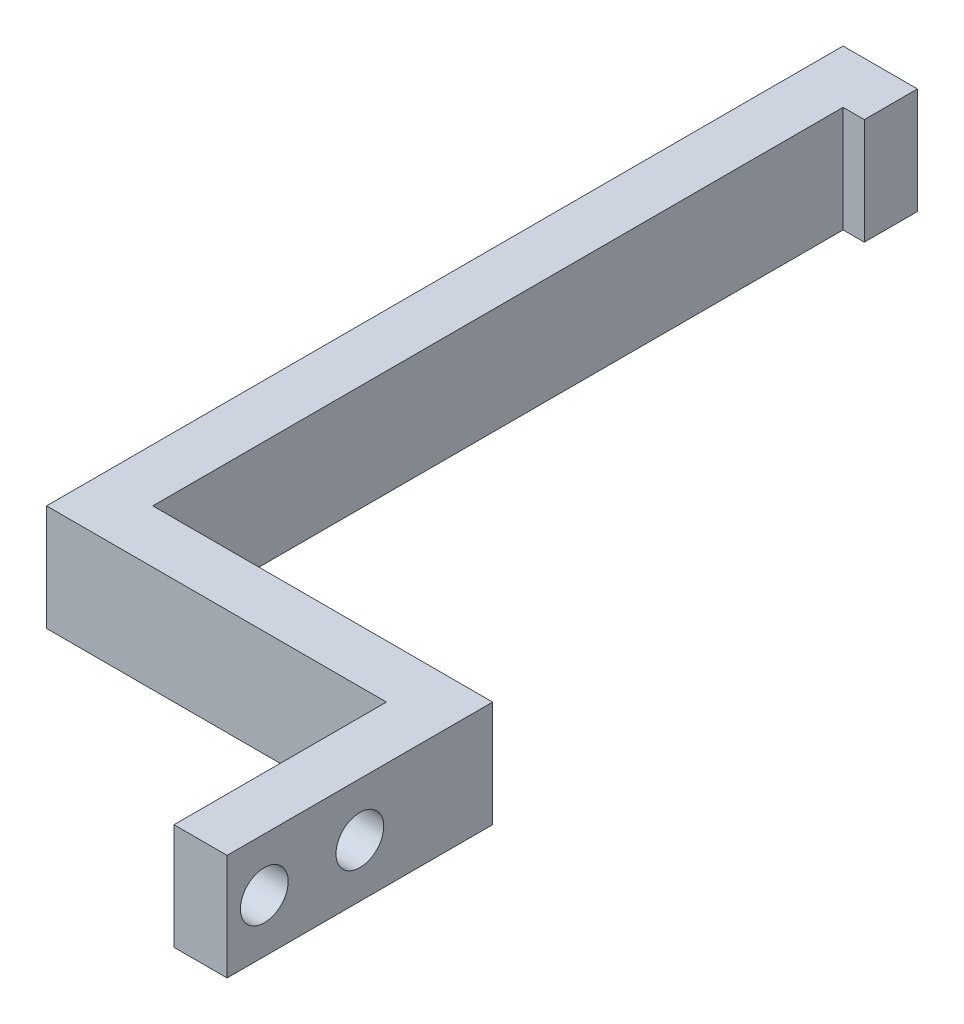
ISO-10303-21;
HEADER;
FILE_DESCRIPTION(('STEP AP214'),'2;1');
FILE_NAME('part.step','',(''),(''),'','','');
FILE_SCHEMA(('AUTOMOTIVE_DESIGN { 1 0 10303 214 1 1 1 1 }'));
ENDSEC;
DATA;
#1=APPLICATION_CONTEXT('core data for automotive mechanical design processes');
#2=APPLICATION_PROTOCOL_DEFINITION('international standard','automotive_design',2000,#1);
#3=PRODUCT_CONTEXT('',#1,'mechanical');
#4=PRODUCT('Part','Part','',(#3));
#5=PRODUCT_RELATED_PRODUCT_CATEGORY('part','',(#4));
#6=PRODUCT_DEFINITION_FORMATION('','',#4);
#7=PRODUCT_DEFINITION_CONTEXT('part definition',#1,'design');
#8=PRODUCT_DEFINITION('design','',#6,#7);
#9=PRODUCT_DEFINITION_SHAPE('','',#8);
#10=(LENGTH_UNIT() NAMED_UNIT(*) SI_UNIT(.MILLI.,.METRE.));
#11=(NAMED_UNIT(*) PLANE_ANGLE_UNIT() SI_UNIT($,.RADIAN.));
#12=(NAMED_UNIT(*) SI_UNIT($,.STERADIAN.) SOLID_ANGLE_UNIT());
#13=UNCERTAINTY_MEASURE_WITH_UNIT(LENGTH_MEASURE(1.E-05),#10,'distance_accuracy_value','');
#14=(GEOMETRIC_REPRESENTATION_CONTEXT(3) GLOBAL_UNCERTAINTY_ASSIGNED_CONTEXT((#13)) GLOBAL_UNIT_ASSIGNED_CONTEXT((#10,
#11,#12)) REPRESENTATION_CONTEXT('',''));
#15=CARTESIAN_POINT('',(0.,0.,0.));
#16=DIRECTION('',(0.,0.,1.));
#17=DIRECTION('',(1.,0.,0.));
#18=AXIS2_PLACEMENT_3D('',#15,#16,#17);
#19=CARTESIAN_POINT('',(-5.,10.,0.));
#20=DIRECTION('',(1.,0.,0.));
#21=DIRECTION('',(0.,0.,-1.));
#22=AXIS2_PLACEMENT_3D('',#19,#20,#21);
#23=PLANE('',#22);
#24=CARTESIAN_POINT('',(-5.,5.,-3.5));
#25=DIRECTION('',(1.,0.,0.));
#26=DIRECTION('',(0.,0.,-1.));
#27=AXIS2_PLACEMENT_3D('',#24,#25,#26);
#28=CIRCLE('',#27,2.25);
#29=CARTESIAN_POINT('',(-5.,5.,-5.75));
#30=VERTEX_POINT('',#29);
#31=EDGE_CURVE('E159',#30,#30,#28,.T.);
#32=ORIENTED_EDGE('',*,*,#31,.T.);
#33=EDGE_LOOP('',(#32));
#34=FACE_BOUND('',#33,.T.);
#35=CARTESIAN_POINT('',(-5.,5.,-12.5));
#36=DIRECTION('',(1.,0.,0.));
#37=DIRECTION('',(0.,0.,-1.));
#38=AXIS2_PLACEMENT_3D('',#35,#36,#37);
#39=CIRCLE('',#38,2.25);
#40=CARTESIAN_POINT('',(-5.,5.,-14.75));
#41=VERTEX_POINT('',#40);
#42=EDGE_CURVE('E267',#41,#41,#39,.T.);
#43=ORIENTED_EDGE('',*,*,#42,.T.);
#44=EDGE_LOOP('',(#43));
#45=FACE_BOUND('',#44,.T.);
#46=DIRECTION('',(0.,0.,1.));
#47=VECTOR('',#46,1.);
#48=CARTESIAN_POINT('',(-5.,0.,0.));
#49=LINE('',#48,#47);
#50=CARTESIAN_POINT('',(-5.,0.,-20.));
#51=VERTEX_POINT('',#50);
#52=CARTESIAN_POINT('',(-5.,0.,0.));
#53=VERTEX_POINT('',#52);
#54=EDGE_CURVE('E154',#51,#53,#49,.T.);
#55=ORIENTED_EDGE('',*,*,#54,.T.);
#56=DIRECTION('',(0.,-1.,0.));
#57=VECTOR('',#56,1.);
#58=CARTESIAN_POINT('',(-5.,10.,0.));
#59=LINE('',#58,#57);
#60=CARTESIAN_POINT('',(-5.,10.,0.));
#61=VERTEX_POINT('',#60);
#62=EDGE_CURVE('E11',#61,#53,#59,.T.);
#63=ORIENTED_EDGE('',*,*,#62,.F.);
#64=DIRECTION('',(0.,0.,1.));
#65=VECTOR('',#64,1.);
#66=CARTESIAN_POINT('',(-5.,10.,0.));
#67=LINE('',#66,#65);
#68=CARTESIAN_POINT('',(-5.,10.,-20.));
#69=VERTEX_POINT('',#68);
#70=EDGE_CURVE('E186',#69,#61,#67,.T.);
#71=ORIENTED_EDGE('',*,*,#70,.F.);
#72=DIRECTION('',(0.,-1.,0.));
#73=VECTOR('',#72,1.);
#74=CARTESIAN_POINT('',(-5.,10.,-20.));
#75=LINE('',#74,#73);
#76=EDGE_CURVE('E150',#69,#51,#75,.T.);
#77=ORIENTED_EDGE('',*,*,#76,.T.);
#78=EDGE_LOOP('',(#55,#63,#71,#77));
#79=FACE_BOUND('',#78,.T.);
#80=ADVANCED_FACE('F41',(#34,#45,#79),#23,.F.);
#81=CARTESIAN_POINT('',(0.,10.,0.));
#82=DIRECTION('',(0.,0.,-1.));
#83=DIRECTION('',(-1.,0.,0.));
#84=AXIS2_PLACEMENT_3D('',#81,#82,#83);
#85=PLANE('',#84);
#86=DIRECTION('',(1.,0.,0.));
#87=VECTOR('',#86,1.);
#88=CARTESIAN_POINT('',(0.,0.,0.));
#89=LINE('',#88,#87);
#90=CARTESIAN_POINT('',(0.,0.,0.));
#91=VERTEX_POINT('',#90);
#92=EDGE_CURVE('E158',#53,#91,#89,.T.);
#93=ORIENTED_EDGE('',*,*,#92,.T.);
#94=DIRECTION('',(0.,-1.,0.));
#95=VECTOR('',#94,1.);
#96=CARTESIAN_POINT('',(0.,10.,0.));
#97=LINE('',#96,#95);
#98=CARTESIAN_POINT('',(0.,10.,0.));
#99=VERTEX_POINT('',#98);
#100=EDGE_CURVE('E50',#99,#91,#97,.T.);
#101=ORIENTED_EDGE('',*,*,#100,.F.);
#102=DIRECTION('',(1.,0.,0.));
#103=VECTOR('',#102,1.);
#104=CARTESIAN_POINT('',(0.,10.,0.));
#105=LINE('',#104,#103);
#106=EDGE_CURVE('E107',#61,#99,#105,.T.);
#107=ORIENTED_EDGE('',*,*,#106,.F.);
#108=ORIENTED_EDGE('',*,*,#62,.T.);
#109=EDGE_LOOP('',(#93,#101,#107,#108));
#110=FACE_BOUND('',#109,.T.);
#111=ADVANCED_FACE('F257',(#110),#85,.F.);
#112=CARTESIAN_POINT('',(0.,10.,0.));
#113=DIRECTION('',(-1.,0.,0.));
#114=DIRECTION('',(0.,0.,1.));
#115=AXIS2_PLACEMENT_3D('',#112,#113,#114);
#116=PLANE('',#115);
#117=CARTESIAN_POINT('',(0.,5.,-3.5));
#118=DIRECTION('',(1.,0.,0.));
#119=DIRECTION('',(0.,0.,-1.));
#120=AXIS2_PLACEMENT_3D('',#117,#118,#119);
#121=CIRCLE('',#120,2.25);
#122=CARTESIAN_POINT('',(0.,5.,-5.75));
#123=VERTEX_POINT('',#122);
#124=EDGE_CURVE('E270',#123,#123,#121,.T.);
#125=ORIENTED_EDGE('',*,*,#124,.F.);
#126=EDGE_LOOP('',(#125));
#127=FACE_BOUND('',#126,.T.);
#128=CARTESIAN_POINT('',(0.,5.,-12.5));
#129=DIRECTION('',(1.,0.,0.));
#130=DIRECTION('',(0.,0.,-1.));
#131=AXIS2_PLACEMENT_3D('',#128,#129,#130);
#132=CIRCLE('',#131,2.25);
#133=CARTESIAN_POINT('',(0.,5.,-14.75));
#134=VERTEX_POINT('',#133);
#135=EDGE_CURVE('E276',#134,#134,#132,.T.);
#136=ORIENTED_EDGE('',*,*,#135,.F.);
#137=EDGE_LOOP('',(#136));
#138=FACE_BOUND('',#137,.T.);
#139=DIRECTION('',(0.,0.,-1.));
#140=VECTOR('',#139,1.);
#141=CARTESIAN_POINT('',(0.,0.,0.));
#142=LINE('',#141,#140);
#143=CARTESIAN_POINT('',(0.,0.,-25.));
#144=VERTEX_POINT('',#143);
#145=EDGE_CURVE('E162',#91,#144,#142,.T.);
#146=ORIENTED_EDGE('',*,*,#145,.T.);
#147=DIRECTION('',(0.,-1.,0.));
#148=VECTOR('',#147,1.);
#149=CARTESIAN_POINT('',(0.,10.,-25.));
#150=LINE('',#149,#148);
#151=CARTESIAN_POINT('',(0.,10.,-25.));
#152=VERTEX_POINT('',#151);
#153=EDGE_CURVE('E203',#152,#144,#150,.T.);
#154=ORIENTED_EDGE('',*,*,#153,.F.);
#155=DIRECTION('',(0.,0.,-1.));
#156=VECTOR('',#155,1.);
#157=CARTESIAN_POINT('',(0.,10.,0.));
#158=LINE('',#157,#156);
#159=EDGE_CURVE('E213',#99,#152,#158,.T.);
#160=ORIENTED_EDGE('',*,*,#159,.F.);
#161=ORIENTED_EDGE('',*,*,#100,.T.);
#162=EDGE_LOOP('',(#146,#154,#160,#161));
#163=FACE_BOUND('',#162,.T.);
#164=ADVANCED_FACE('F211',(#127,#138,#163),#116,.F.);
#165=CARTESIAN_POINT('',(0.,10.,-25.));
#166=DIRECTION('',(0.,0.,1.));
#167=DIRECTION('',(1.,0.,0.));
#168=AXIS2_PLACEMENT_3D('',#165,#166,#167);
#169=PLANE('',#168);
#170=DIRECTION('',(-1.,0.,0.));
#171=VECTOR('',#170,1.);
#172=CARTESIAN_POINT('',(0.,0.,-25.));
#173=LINE('',#172,#171);
#174=CARTESIAN_POINT('',(-32.,0.,-25.));
#175=VERTEX_POINT('',#174);
#176=EDGE_CURVE('E165',#144,#175,#173,.T.);
#177=ORIENTED_EDGE('',*,*,#176,.T.);
#178=DIRECTION('',(0.,-1.,0.));
#179=VECTOR('',#178,1.);
#180=CARTESIAN_POINT('',(-32.,10.,-25.));
#181=LINE('',#180,#179);
#182=CARTESIAN_POINT('',(-32.,10.,-25.));
#183=VERTEX_POINT('',#182);
#184=EDGE_CURVE('E199',#183,#175,#181,.T.);
#185=ORIENTED_EDGE('',*,*,#184,.F.);
#186=DIRECTION('',(-1.,0.,0.));
#187=VECTOR('',#186,1.);
#188=CARTESIAN_POINT('',(0.,10.,-25.));
#189=LINE('',#188,#187);
#190=EDGE_CURVE('E231',#152,#183,#189,.T.);
#191=ORIENTED_EDGE('',*,*,#190,.F.);
#192=ORIENTED_EDGE('',*,*,#153,.T.);
#193=EDGE_LOOP('',(#177,#185,#191,#192));
#194=FACE_BOUND('',#193,.T.);
#195=ADVANCED_FACE('F221',(#194),#169,.F.);
#196=CARTESIAN_POINT('',(-32.,10.,0.));
#197=DIRECTION('',(-1.,0.,0.));
#198=DIRECTION('',(0.,0.,1.));
#199=AXIS2_PLACEMENT_3D('',#196,#197,#198);
#200=PLANE('',#199);
#201=DIRECTION('',(0.,0.,-1.));
#202=VECTOR('',#201,1.);
#203=CARTESIAN_POINT('',(-32.,0.,0.));
#204=LINE('',#203,#202);
#205=CARTESIAN_POINT('',(-32.,0.,-90.));
#206=VERTEX_POINT('',#205);
#207=EDGE_CURVE('E168',#175,#206,#204,.T.);
#208=ORIENTED_EDGE('',*,*,#207,.T.);
#209=DIRECTION('',(0.,-1.,0.));
#210=VECTOR('',#209,1.);
#211=CARTESIAN_POINT('',(-32.,10.,-90.));
#212=LINE('',#211,#210);
#213=CARTESIAN_POINT('',(-32.,10.,-90.));
#214=VERTEX_POINT('',#213);
#215=EDGE_CURVE('E196',#214,#206,#212,.T.);
#216=ORIENTED_EDGE('',*,*,#215,.F.);
#217=DIRECTION('',(0.,0.,-1.));
#218=VECTOR('',#217,1.);
#219=CARTESIAN_POINT('',(-32.,10.,0.));
#220=LINE('',#219,#218);
#221=EDGE_CURVE('E227',#183,#214,#220,.T.);
#222=ORIENTED_EDGE('',*,*,#221,.F.);
#223=ORIENTED_EDGE('',*,*,#184,.T.);
#224=EDGE_LOOP('',(#208,#216,#222,#223));
#225=FACE_BOUND('',#224,.T.);
#226=ADVANCED_FACE('F225',(#225),#200,.F.);
#227=CARTESIAN_POINT('',(0.,10.,-90.));
#228=DIRECTION('',(0.,0.,1.));
#229=DIRECTION('',(1.,0.,0.));
#230=AXIS2_PLACEMENT_3D('',#227,#228,#229);
#231=PLANE('',#230);
#232=DIRECTION('',(-1.,0.,0.));
#233=VECTOR('',#232,1.);
#234=CARTESIAN_POINT('',(0.,0.,-90.));
#235=LINE('',#234,#233);
#236=CARTESIAN_POINT('',(-30.,0.,-90.));
#237=VERTEX_POINT('',#236);
#238=EDGE_CURVE('E172',#237,#206,#235,.T.);
#239=ORIENTED_EDGE('',*,*,#238,.F.);
#240=DIRECTION('',(0.,-1.,0.));
#241=VECTOR('',#240,1.);
#242=CARTESIAN_POINT('',(-30.,10.,-90.));
#243=LINE('',#242,#241);
#244=CARTESIAN_POINT('',(-30.,10.,-90.));
#245=VERTEX_POINT('',#244);
#246=EDGE_CURVE('E193',#245,#237,#243,.T.);
#247=ORIENTED_EDGE('',*,*,#246,.F.);
#248=DIRECTION('',(-1.,0.,0.));
#249=VECTOR('',#248,1.);
#250=CARTESIAN_POINT('',(0.,10.,-90.));
#251=LINE('',#250,#249);
#252=EDGE_CURVE('E230',#245,#214,#251,.T.);
#253=ORIENTED_EDGE('',*,*,#252,.T.);
#254=ORIENTED_EDGE('',*,*,#215,.T.);
#255=EDGE_LOOP('',(#239,#247,#253,#254));
#256=FACE_BOUND('',#255,.T.);
#257=ADVANCED_FACE('F301',(#256),#231,.T.);
#258=CARTESIAN_POINT('',(-30.,10.,0.));
#259=DIRECTION('',(1.,0.,0.));
#260=DIRECTION('',(0.,0.,-1.));
#261=AXIS2_PLACEMENT_3D('',#258,#259,#260);
#262=PLANE('',#261);
#263=DIRECTION('',(0.,0.,1.));
#264=VECTOR('',#263,1.);
#265=CARTESIAN_POINT('',(-30.,0.,0.));
#266=LINE('',#265,#264);
#267=CARTESIAN_POINT('',(-30.,0.,-95.));
#268=VERTEX_POINT('',#267);
#269=EDGE_CURVE('E176',#268,#237,#266,.T.);
#270=ORIENTED_EDGE('',*,*,#269,.F.);
#271=DIRECTION('',(0.,-1.,0.));
#272=VECTOR('',#271,1.);
#273=CARTESIAN_POINT('',(-30.,10.,-95.));
#274=LINE('',#273,#272);
#275=CARTESIAN_POINT('',(-30.,10.,-95.));
#276=VERTEX_POINT('',#275);
#277=EDGE_CURVE('E143',#276,#268,#274,.T.);
#278=ORIENTED_EDGE('',*,*,#277,.F.);
#279=DIRECTION('',(0.,0.,1.));
#280=VECTOR('',#279,1.);
#281=CARTESIAN_POINT('',(-30.,10.,0.));
#282=LINE('',#281,#280);
#283=EDGE_CURVE('E134',#276,#245,#282,.T.);
#284=ORIENTED_EDGE('',*,*,#283,.T.);
#285=ORIENTED_EDGE('',*,*,#246,.T.);
#286=EDGE_LOOP('',(#270,#278,#284,#285));
#287=FACE_BOUND('',#286,.T.);
#288=ADVANCED_FACE('F241',(#287),#262,.T.);
#289=CARTESIAN_POINT('',(0.,10.,-95.));
#290=DIRECTION('',(0.,0.,1.));
#291=DIRECTION('',(1.,0.,0.));
#292=AXIS2_PLACEMENT_3D('',#289,#290,#291);
#293=PLANE('',#292);
#294=DIRECTION('',(-1.,0.,0.));
#295=VECTOR('',#294,1.);
#296=CARTESIAN_POINT('',(0.,0.,-95.));
#297=LINE('',#296,#295);
#298=CARTESIAN_POINT('',(-37.,0.,-95.));
#299=VERTEX_POINT('',#298);
#300=EDGE_CURVE('E141',#268,#299,#297,.T.);
#301=ORIENTED_EDGE('',*,*,#300,.T.);
#302=DIRECTION('',(0.,-1.,0.));
#303=VECTOR('',#302,1.);
#304=CARTESIAN_POINT('',(-37.,10.,-95.));
#305=LINE('',#304,#303);
#306=CARTESIAN_POINT('',(-37.,10.,-95.));
#307=VERTEX_POINT('',#306);
#308=EDGE_CURVE('E138',#307,#299,#305,.T.);
#309=ORIENTED_EDGE('',*,*,#308,.F.);
#310=DIRECTION('',(-1.,0.,0.));
#311=VECTOR('',#310,1.);
#312=CARTESIAN_POINT('',(0.,10.,-95.));
#313=LINE('',#312,#311);
#314=EDGE_CURVE('E127',#276,#307,#313,.T.);
#315=ORIENTED_EDGE('',*,*,#314,.F.);
#316=ORIENTED_EDGE('',*,*,#277,.T.);
#317=EDGE_LOOP('',(#301,#309,#315,#316));
#318=FACE_BOUND('',#317,.T.);
#319=ADVANCED_FACE('F139',(#318),#293,.F.);
#320=CARTESIAN_POINT('',(-37.,10.,0.));
#321=DIRECTION('',(1.,0.,0.));
#322=DIRECTION('',(0.,0.,-1.));
#323=AXIS2_PLACEMENT_3D('',#320,#321,#322);
#324=PLANE('',#323);
#325=DIRECTION('',(0.,0.,1.));
#326=VECTOR('',#325,1.);
#327=CARTESIAN_POINT('',(-37.,0.,0.));
#328=LINE('',#327,#326);
#329=CARTESIAN_POINT('',(-37.,0.,-20.));
#330=VERTEX_POINT('',#329);
#331=EDGE_CURVE('E93',#299,#330,#328,.T.);
#332=ORIENTED_EDGE('',*,*,#331,.T.);
#333=DIRECTION('',(0.,-1.,0.));
#334=VECTOR('',#333,1.);
#335=CARTESIAN_POINT('',(-37.,10.,-20.));
#336=LINE('',#335,#334);
#337=CARTESIAN_POINT('',(-37.,10.,-20.));
#338=VERTEX_POINT('',#337);
#339=EDGE_CURVE('E144',#338,#330,#336,.T.);
#340=ORIENTED_EDGE('',*,*,#339,.F.);
#341=DIRECTION('',(0.,0.,1.));
#342=VECTOR('',#341,1.);
#343=CARTESIAN_POINT('',(-37.,10.,0.));
#344=LINE('',#343,#342);
#345=EDGE_CURVE('E131',#307,#338,#344,.T.);
#346=ORIENTED_EDGE('',*,*,#345,.F.);
#347=ORIENTED_EDGE('',*,*,#308,.T.);
#348=EDGE_LOOP('',(#332,#340,#346,#347));
#349=FACE_BOUND('',#348,.T.);
#350=ADVANCED_FACE('F146',(#349),#324,.F.);
#351=CARTESIAN_POINT('',(0.,10.,-20.));
#352=DIRECTION('',(0.,0.,-1.));
#353=DIRECTION('',(-1.,0.,0.));
#354=AXIS2_PLACEMENT_3D('',#351,#352,#353);
#355=PLANE('',#354);
#356=DIRECTION('',(1.,0.,0.));
#357=VECTOR('',#356,1.);
#358=CARTESIAN_POINT('',(0.,0.,-20.));
#359=LINE('',#358,#357);
#360=EDGE_CURVE('E99',#330,#51,#359,.T.);
#361=ORIENTED_EDGE('',*,*,#360,.T.);
#362=ORIENTED_EDGE('',*,*,#76,.F.);
#363=DIRECTION('',(1.,0.,0.));
#364=VECTOR('',#363,1.);
#365=CARTESIAN_POINT('',(0.,10.,-20.));
#366=LINE('',#365,#364);
#367=EDGE_CURVE('E58',#338,#69,#366,.T.);
#368=ORIENTED_EDGE('',*,*,#367,.F.);
#369=ORIENTED_EDGE('',*,*,#339,.T.);
#370=EDGE_LOOP('',(#361,#362,#368,#369));
#371=FACE_BOUND('',#370,.T.);
#372=ADVANCED_FACE('F246',(#371),#355,.F.);
#373=CARTESIAN_POINT('',(0.,10.,0.));
#374=DIRECTION('',(0.,1.,0.));
#375=DIRECTION('',(0.,0.,1.));
#376=AXIS2_PLACEMENT_3D('',#373,#374,#375);
#377=PLANE('',#376);
#378=ORIENTED_EDGE('',*,*,#70,.T.);
#379=ORIENTED_EDGE('',*,*,#106,.T.);
#380=ORIENTED_EDGE('',*,*,#159,.T.);
#381=ORIENTED_EDGE('',*,*,#190,.T.);
#382=ORIENTED_EDGE('',*,*,#221,.T.);
#383=ORIENTED_EDGE('',*,*,#252,.F.);
#384=ORIENTED_EDGE('',*,*,#283,.F.);
#385=ORIENTED_EDGE('',*,*,#314,.T.);
#386=ORIENTED_EDGE('',*,*,#345,.T.);
#387=ORIENTED_EDGE('',*,*,#367,.T.);
#388=EDGE_LOOP('',(#378,#379,#380,#381,#382,#383,#384,#385,#386,#387));
#389=FACE_BOUND('',#388,.T.);
#390=ADVANCED_FACE('F129',(#389),#377,.T.);
#391=CARTESIAN_POINT('',(0.,0.,0.));
#392=DIRECTION('',(0.,1.,0.));
#393=DIRECTION('',(0.,0.,1.));
#394=AXIS2_PLACEMENT_3D('',#391,#392,#393);
#395=PLANE('',#394);
#396=ORIENTED_EDGE('',*,*,#54,.F.);
#397=ORIENTED_EDGE('',*,*,#360,.F.);
#398=ORIENTED_EDGE('',*,*,#331,.F.);
#399=ORIENTED_EDGE('',*,*,#300,.F.);
#400=ORIENTED_EDGE('',*,*,#269,.T.);
#401=ORIENTED_EDGE('',*,*,#238,.T.);
#402=ORIENTED_EDGE('',*,*,#207,.F.);
#403=ORIENTED_EDGE('',*,*,#176,.F.);
#404=ORIENTED_EDGE('',*,*,#145,.F.);
#405=ORIENTED_EDGE('',*,*,#92,.F.);
#406=EDGE_LOOP('',(#396,#397,#398,#399,#400,#401,#402,#403,#404,#405));
#407=FACE_BOUND('',#406,.T.);
#408=ADVANCED_FACE('F217',(#407),#395,.F.);
#409=CARTESIAN_POINT('',(-37.,5.,-12.5));
#410=DIRECTION('',(1.,0.,0.));
#411=DIRECTION('',(0.,0.,-1.));
#412=AXIS2_PLACEMENT_3D('',#409,#410,#411);
#413=CYLINDRICAL_SURFACE('',#412,2.25);
#414=ORIENTED_EDGE('',*,*,#135,.T.);
#415=EDGE_LOOP('',(#414));
#416=FACE_BOUND('',#415,.T.);
#417=ORIENTED_EDGE('',*,*,#42,.F.);
#418=EDGE_LOOP('',(#417));
#419=FACE_BOUND('',#418,.T.);
#420=ADVANCED_FACE('F288',(#416,#419),#413,.F.);
#421=CARTESIAN_POINT('',(-37.,5.,-3.5));
#422=DIRECTION('',(1.,0.,0.));
#423=DIRECTION('',(0.,0.,-1.));
#424=AXIS2_PLACEMENT_3D('',#421,#422,#423);
#425=CYLINDRICAL_SURFACE('',#424,2.25);
#426=ORIENTED_EDGE('',*,*,#124,.T.);
#427=EDGE_LOOP('',(#426));
#428=FACE_BOUND('',#427,.T.);
#429=ORIENTED_EDGE('',*,*,#31,.F.);
#430=EDGE_LOOP('',(#429));
#431=FACE_BOUND('',#430,.T.);
#432=ADVANCED_FACE('F356',(#428,#431),#425,.F.);
#433=CLOSED_SHELL('',(#80,#111,#164,#195,#226,#257,#288,#319,#350,#372,#390,#408,#420,#432));
#434=MANIFOLD_SOLID_BREP('B2',#433);
#435=ADVANCED_BREP_SHAPE_REPRESENTATION('',(#18,#434),#14);
#436=SHAPE_DEFINITION_REPRESENTATION(#9,#435);
ENDSEC;
END-ISO-10303-21;
